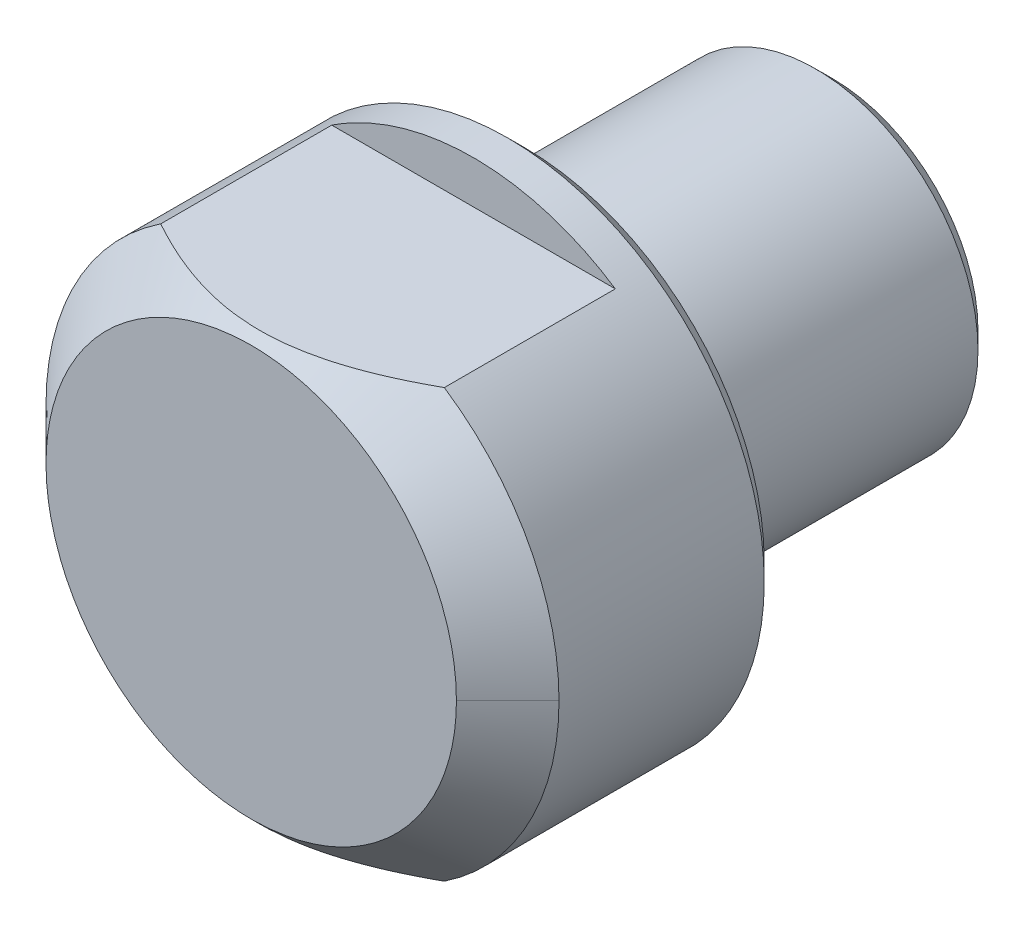
ISO-10303-21;
HEADER;
FILE_DESCRIPTION(('STEP AP214'),'2;1');
FILE_NAME('part.step','',(''),(''),'','','');
FILE_SCHEMA(('AUTOMOTIVE_DESIGN { 1 0 10303 214 1 1 1 1 }'));
ENDSEC;
DATA;
#1=APPLICATION_CONTEXT('core data for automotive mechanical design processes');
#2=APPLICATION_PROTOCOL_DEFINITION('international standard','automotive_design',2000,#1);
#3=PRODUCT_CONTEXT('',#1,'mechanical');
#4=PRODUCT('Part','Part','',(#3));
#5=PRODUCT_RELATED_PRODUCT_CATEGORY('part','',(#4));
#6=PRODUCT_DEFINITION_FORMATION('','',#4);
#7=PRODUCT_DEFINITION_CONTEXT('part definition',#1,'design');
#8=PRODUCT_DEFINITION('design','',#6,#7);
#9=PRODUCT_DEFINITION_SHAPE('','',#8);
#10=(LENGTH_UNIT() NAMED_UNIT(*) SI_UNIT(.MILLI.,.METRE.));
#11=(NAMED_UNIT(*) PLANE_ANGLE_UNIT() SI_UNIT($,.RADIAN.));
#12=(NAMED_UNIT(*) SI_UNIT($,.STERADIAN.) SOLID_ANGLE_UNIT());
#13=UNCERTAINTY_MEASURE_WITH_UNIT(LENGTH_MEASURE(1.E-05),#10,'distance_accuracy_value','');
#14=(GEOMETRIC_REPRESENTATION_CONTEXT(3) GLOBAL_UNCERTAINTY_ASSIGNED_CONTEXT((#13)) GLOBAL_UNIT_ASSIGNED_CONTEXT((#10,
#11,#12)) REPRESENTATION_CONTEXT('',''));
#15=CARTESIAN_POINT('',(0.,0.,0.));
#16=DIRECTION('',(0.,0.,1.));
#17=DIRECTION('',(1.,0.,0.));
#18=AXIS2_PLACEMENT_3D('',#15,#16,#17);
#19=CARTESIAN_POINT('',(-12.,-12.00000046191,34.));
#20=DIRECTION('',(0.,0.,1.));
#21=DIRECTION('',(1.,0.,0.));
#22=AXIS2_PLACEMENT_3D('',#19,#20,#21);
#23=PLANE('',#22);
#24=CARTESIAN_POINT('',(-11.9999243527896,-6.48420379889547E-09,34.));
#25=CARTESIAN_POINT('',(-11.9998701821244,-1.18188406089611,34.));
#26=CARTESIAN_POINT('',(-11.7693491699001,-2.34106911253026,34.));
#27=CARTESIAN_POINT('',(-11.5389343924907,-3.49971995772457,34.));
#28=CARTESIAN_POINT('',(-11.0864844987324,-4.59217224546722,34.));
#29=CARTESIAN_POINT('',(-10.6344555101708,-5.68360824643114,34.));
#30=CARTESIAN_POINT('',(-9.97757244564464,-6.66680077432835,34.));
#31=CARTESIAN_POINT('',(-9.32130046645815,-7.6490786576377,34.));
#32=CARTESIAN_POINT('',(-8.48522787895268,-8.48522788821352,34.));
#33=CARTESIAN_POINT('',(-7.64993307325746,-9.32059926567956,34.));
#34=CARTESIAN_POINT('',(-6.66680076343875,-9.97757245292084,34.));
#35=CARTESIAN_POINT('',(-5.68458304219019,-10.6339344709818,34.));
#36=CARTESIAN_POINT('',(-4.59217223336735,-11.0864845037443,34.));
#37=CARTESIAN_POINT('',(-3.5007776727487,-11.5386135381476,34.));
#38=CARTESIAN_POINT('',(-2.3410690996851,-11.7693491724552,34.));
#39=CARTESIAN_POINT('',(-1.18243938059112,-11.9998701579616,34.));
#40=CARTESIAN_POINT('',(6.61260109169337E-09,-11.9999243527896,34.));
#41=CARTESIAN_POINT('',(1.18133939383284,-11.9999784972012,34.));
#42=CARTESIAN_POINT('',(2.34106911265618,-11.7693491698751,34.));
#43=CARTESIAN_POINT('',(3.49971995783659,-11.5389343924553,34.));
#44=CARTESIAN_POINT('',(4.59217224558585,-11.0864844986832,34.));
#45=CARTESIAN_POINT('',(5.68360824653329,-10.6344555101174,34.));
#46=CARTESIAN_POINT('',(6.66680077443512,-9.9775724455733,34.));
#47=CARTESIAN_POINT('',(7.64907865774437,-9.32130046637198,34.));
#48=CARTESIAN_POINT('',(8.48522788830431,-8.48522787886189,34.));
#49=CARTESIAN_POINT('',(9.32059926576398,-7.64993307315255,34.));
#50=CARTESIAN_POINT('',(9.97757245299216,-6.666800763332,34.));
#51=CARTESIAN_POINT('',(10.6339344710483,-5.68458304206927,34.));
#52=CARTESIAN_POINT('',(11.0864845037934,-4.59217223324872,34.));
#53=CARTESIAN_POINT('',(11.5386135381849,-3.50077767261899,34.));
#54=CARTESIAN_POINT('',(11.7693491724802,-2.34106909955917,34.));
#55=CARTESIAN_POINT('',(11.9998701579746,-1.18243938046758,34.));
#56=CARTESIAN_POINT('',(11.9999243527896,6.74099838449127E-09,34.));
#57=B_SPLINE_CURVE_WITH_KNOTS('',2,(#24,#25,#26,#27,#28,#29,#30,#31,#32,#33,#34,#35,#36,#37,#38,
#39,#40,#41,#42,#43,#44,#45,#46,#47,#48,#49,#50,#51,#52,#53,#54,#55,#56),.UNSPECIFIED.,.F.,.F.,
(3,2,2,2,2,2,2,2,2,2,2,2,2,2,2,2,3),(0.,0.0625,0.125,0.1875,0.25,0.3125,0.375,0.4375,0.5,0.5625,
0.625,0.6875,0.75,0.8125,0.875,0.9375,1.),.UNSPECIFIED.);
#58=CARTESIAN_POINT('',(-11.9999241107255,-3.24211976903176E-09,33.9999648157087));
#59=VERTEX_POINT('',#58);
#60=CARTESIAN_POINT('',(11.9999241107255,2.80589656553716E-09,33.9999648157087));
#61=VERTEX_POINT('',#60);
#62=EDGE_CURVE('E115',#59,#61,#57,.T.);
#63=ORIENTED_EDGE('',*,*,#62,.T.);
#64=CARTESIAN_POINT('',(11.9999239390287,5.05574748732585E-09,34.));
#65=CARTESIAN_POINT('',(11.9998697685014,1.18188401875769,34.));
#66=CARTESIAN_POINT('',(11.7693487643539,2.3410690304803,34.));
#67=CARTESIAN_POINT('',(11.538933995022,3.49971983575883,34.));
#68=CARTESIAN_POINT('',(11.0864841169577,4.59217208594335,34.));
#69=CARTESIAN_POINT('',(10.6344551441014,5.68360804932165,34.));
#70=CARTESIAN_POINT('',(9.97757210228656,6.66680054345005,34.));
#71=CARTESIAN_POINT('',(9.32130014582751,7.64907839296616,34.));
#72=CARTESIAN_POINT('',(8.48522758718247,8.48522759483742,34.));
#73=CARTESIAN_POINT('',(7.64993281033221,9.32059894361422,34.));
#74=CARTESIAN_POINT('',(6.66680053444879,9.977572108301,34.));
#75=CARTESIAN_POINT('',(5.68458284707842,10.6339341038455,34.));
#76=CARTESIAN_POINT('',(4.5921720759417,11.0864841211005,34.));
#77=CARTESIAN_POINT('',(3.50077755296465,11.5386131400147,34.));
#78=CARTESIAN_POINT('',(2.3410690198626,11.7693487664659,34.));
#79=CARTESIAN_POINT('',(1.18243934073473,11.9998697441149,34.));
#80=CARTESIAN_POINT('',(-5.76997477574892E-09,11.9999239390287,34.));
#81=CARTESIAN_POINT('',(-1.18133935225094,11.999978083526,34.));
#82=CARTESIAN_POINT('',(-2.34106903118081,11.7693487642146,34.));
#83=CARTESIAN_POINT('',(-3.49971983645007,11.5389339948129,34.));
#84=CARTESIAN_POINT('',(-4.59217208660322,11.0864841166844,34.));
#85=CARTESIAN_POINT('',(-5.68360804998319,10.6344551437502,34.));
#86=CARTESIAN_POINT('',(-6.66680054404391,9.97757210188975,34.));
#87=CARTESIAN_POINT('',(-7.64907839353175,9.32130014535888,34.));
#88=CARTESIAN_POINT('',(-8.48522759534245,8.48522758667744,34.));
#89=CARTESIAN_POINT('',(-9.32059894404942,7.64993280980013,34.));
#90=CARTESIAN_POINT('',(-9.97757210869781,6.66680053385493,34.));
#91=CARTESIAN_POINT('',(-10.6339341041703,5.68458284647319,34.));
#92=CARTESIAN_POINT('',(-11.0864841213739,4.59217207528184,34.));
#93=CARTESIAN_POINT('',(-11.5386131402193,3.50077755229182,34.));
#94=CARTESIAN_POINT('',(-11.7693487666052,2.34106901916209,34.));
#95=CARTESIAN_POINT('',(-11.9998697441876,1.18243934001341,34.));
#96=CARTESIAN_POINT('',(-11.9999239390287,-6.48420379889547E-09,34.));
#97=B_SPLINE_CURVE_WITH_KNOTS('',2,(#64,#65,#66,#67,#68,#69,#70,#71,#72,#73,#74,#75,#76,#77,#78,
#79,#80,#81,#82,#83,#84,#85,#86,#87,#88,#89,#90,#91,#92,#93,#94,#95,#96),.UNSPECIFIED.,.F.,.F.,
(3,2,2,2,2,2,2,2,2,2,2,2,2,2,2,2,3),(0.,0.0625,0.125,0.1875,0.25,0.3125,0.375,0.4375,0.5,0.5625,
0.625,0.6875,0.75,0.8125,0.875,0.9375,1.),.UNSPECIFIED.);
#98=EDGE_CURVE('E134',#61,#59,#97,.T.);
#99=ORIENTED_EDGE('',*,*,#98,.T.);
#100=EDGE_LOOP('',(#63,#99));
#101=FACE_BOUND('',#100,.T.);
#102=ADVANCED_FACE('F16',(#101),#23,.T.);
#103=CARTESIAN_POINT('',(-8.291561975888,-15.01539198559,21.));
#104=DIRECTION('',(0.,0.,1.));
#105=DIRECTION('',(1.,0.,0.));
#106=AXIS2_PLACEMENT_3D('',#103,#104,#105);
#107=PLANE('',#106);
#108=CARTESIAN_POINT('',(-8.29156197588815,-12.5000000000002,21.));
#109=CARTESIAN_POINT('',(-7.3745195762119,-13.1082002763477,21.));
#110=CARTESIAN_POINT('',(-6.37910392753331,-13.5759726385158,21.));
#111=CARTESIAN_POINT('',(-5.38393296632282,-14.0436300155165,21.));
#112=CARTESIAN_POINT('',(-4.33012701892199,-14.3614066163451,21.));
#113=CARTESIAN_POINT('',(-3.27737422970128,-14.678865635908,21.));
#114=CARTESIAN_POINT('',(-2.18848129473649,-14.8394929031483,21.));
#115=CARTESIAN_POINT('',(-1.10067658337028,-14.999959641858,21.));
#116=CARTESIAN_POINT('',(0.,-15.,21.));
#117=CARTESIAN_POINT('',(1.09957658336247,-15.0000403178087,21.));
#118=CARTESIAN_POINT('',(2.18848129473649,-14.8394929031483,21.));
#119=CARTESIAN_POINT('',(3.27629777073172,-14.6791059372166,21.));
#120=CARTESIAN_POINT('',(4.330127018922,-14.3614066163451,21.));
#121=CARTESIAN_POINT('',(5.38290308562081,-14.0440247995144,21.));
#122=CARTESIAN_POINT('',(6.37910392753333,-13.5759726385158,21.));
#123=CARTESIAN_POINT('',(7.37405875763431,-13.1085059001513,21.));
#124=CARTESIAN_POINT('',(8.29156197588816,-12.5000000000002,21.));
#125=B_SPLINE_CURVE_WITH_KNOTS('',2,(#108,#109,#110,#111,#112,#113,#114,#115,#116,#117,#118,
#119,#120,#121,#122,#123,#124),.UNSPECIFIED.,.F.,.F.,(3,2,2,2,2,2,2,2,3),(0.,0.125,0.25,0.375,
0.5,0.625,0.75,0.875,1.),.UNSPECIFIED.);
#126=CARTESIAN_POINT('',(-8.29156197588811,-12.5000000000001,21.));
#127=VERTEX_POINT('',#126);
#128=CARTESIAN_POINT('',(8.29156197588808,-12.5000000000001,21.));
#129=VERTEX_POINT('',#128);
#130=EDGE_CURVE('E488',#127,#129,#125,.T.);
#131=ORIENTED_EDGE('',*,*,#130,.T.);
#132=DIRECTION('',(-1.,0.,0.));
#133=VECTOR('',#132,1.);
#134=CARTESIAN_POINT('',(-9.99200722162641E-13,-12.5,21.));
#135=LINE('',#134,#133);
#136=EDGE_CURVE('E495',#129,#127,#135,.T.);
#137=ORIENTED_EDGE('',*,*,#136,.T.);
#138=EDGE_LOOP('',(#131,#137));
#139=FACE_BOUND('',#138,.T.);
#140=ADVANCED_FACE('F160',(#139),#107,.T.);
#141=CARTESIAN_POINT('',(0.,0.,33.9999299211796));
#142=DIRECTION('',(0.,0.,-1.));
#143=DIRECTION('',(-1.,0.,0.));
#144=AXIS2_PLACEMENT_3D('',#141,#142,#143);
#145=CONICAL_SURFACE('',#144,11.9999243527896,0.78539209147865);
#146=DIRECTION('',(-0.70710246276539,-2.97912677885524E-10,0.707111099581332));
#147=VECTOR('',#146,1.);
#148=CARTESIAN_POINT('',(13.499954398765,5.68772954140161E-09,32.499880707705));
#149=LINE('',#148,#147);
#150=CARTESIAN_POINT('',(14.99995419707,3.15974638310727E-09,30.9998627613045));
#151=VERTEX_POINT('',#150);
#152=EDGE_CURVE('E128',#151,#61,#149,.T.);
#153=ORIENTED_EDGE('',*,*,#152,.T.);
#154=ORIENTED_EDGE('',*,*,#62,.F.);
#155=DIRECTION('',(-0.70710246276539,-3.82085204968641E-10,-0.707111099581332));
#156=VECTOR('',#155,1.);
#157=CARTESIAN_POINT('',(-13.499954398765,-7.29474597407936E-09,32.499880707705));
#158=LINE('',#157,#156);
#159=CARTESIAN_POINT('',(-14.9999541970875,-6.07894559484566E-09,30.999862761287));
#160=VERTEX_POINT('',#159);
#161=EDGE_CURVE('E125',#59,#160,#158,.T.);
#162=ORIENTED_EDGE('',*,*,#161,.T.);
#163=CARTESIAN_POINT('',(0.,0.,30.99981784131));
#164=DIRECTION('',(0.,0.,1.));
#165=DIRECTION('',(1.,0.,0.));
#166=AXIS2_PLACEMENT_3D('',#163,#164,#165);
#167=CIRCLE('',#166,15.);
#168=CARTESIAN_POINT('',(-8.29156197588946,-12.5000000000007,30.9998178413107));
#169=VERTEX_POINT('',#168);
#170=EDGE_CURVE('E497',#160,#169,#167,.T.);
#171=ORIENTED_EDGE('',*,*,#170,.T.);
#172=CARTESIAN_POINT('',(-8.29156197589155,-12.5000000000023,30.9998178413129));
#173=CARTESIAN_POINT('',(-8.04159538373175,-12.5000040380364,31.1379630767079));
#174=CARTESIAN_POINT('',(-7.78979971618752,-12.4999586238793,31.2728751221349));
#175=CARTESIAN_POINT('',(-7.29051369287207,-12.4998358769905,31.5307853038968));
#176=CARTESIAN_POINT('',(-7.0431495139075,-12.4997596299867,31.6540281779718));
#177=CARTESIAN_POINT('',(-6.55210776095944,-12.4996361078085,31.8886278219121));
#178=CARTESIAN_POINT('',(-6.30854943111576,-12.499588016574,32.0002330705373));
#179=CARTESIAN_POINT('',(-5.8244296730648,-12.4995590982013,32.2115454185947));
#180=CARTESIAN_POINT('',(-5.58397598796708,-12.4995764210912,32.3114985416598));
#181=CARTESIAN_POINT('',(-5.10529587391244,-12.4996766860168,32.4995126538032));
#182=CARTESIAN_POINT('',(-4.86716124358852,-12.4997579959097,32.5878064799175));
#183=CARTESIAN_POINT('',(-4.39227430441573,-12.4999140352618,32.7525238207631));
#184=CARTESIAN_POINT('',(-4.15559387018792,-12.499988865502,32.8291537053185));
#185=CARTESIAN_POINT('',(-3.69745858428332,-12.5000102723048,32.9661375920962));
#186=CARTESIAN_POINT('',(-3.4762439130335,-12.4999663314688,33.027292429739));
#187=CARTESIAN_POINT('',(-3.03536833646661,-12.4999130430869,33.1384037077579));
#188=CARTESIAN_POINT('',(-2.81575474367298,-12.4999030688845,33.1885468541422));
#189=CARTESIAN_POINT('',(-2.37710921248065,-12.4999431525524,33.2776721015382));
#190=CARTESIAN_POINT('',(-2.15810400181915,-12.4999924654425,33.316785240474));
#191=CARTESIAN_POINT('',(-1.72314442602087,-12.5000073727083,33.3834201874841));
#192=CARTESIAN_POINT('',(-1.50722558474451,-12.4999747427222,33.411172945136));
#193=CARTESIAN_POINT('',(-1.07627657652546,-12.4999355417714,33.4554759966663));
#194=CARTESIAN_POINT('',(-0.861257013072269,-12.4999287297132,33.472128730857));
#195=CARTESIAN_POINT('',(-0.431002653256192,-12.4999627349683,33.4942992393994));
#196=CARTESIAN_POINT('',(-0.215768811769113,-12.5000034729756,33.4998355124143));
#197=CARTESIAN_POINT('',(0.214718521108538,-12.4999965267228,33.4998608680216));
#198=CARTESIAN_POINT('',(0.42997201256184,-12.4999488346827,33.4943489786075));
#199=CARTESIAN_POINT('',(0.860258210818122,-12.4999070967456,33.4722191604876));
#200=CARTESIAN_POINT('',(1.07528998598339,-12.4999131384099,33.4555831453646));
#201=CARTESIAN_POINT('',(1.50625656332765,-12.4999595734962,33.4113041207847));
#202=CARTESIAN_POINT('',(1.72218079109061,-12.5000002899734,33.383558902392));
#203=CARTESIAN_POINT('',(2.15747841042425,-12.4999997032247,33.316890194706));
#204=CARTESIAN_POINT('',(2.37681380419531,-12.4999564524454,33.2777196201537));
#205=CARTESIAN_POINT('',(2.81609036485942,-12.4999194635698,33.1884620800518));
#206=CARTESIAN_POINT('',(3.03600502656535,-12.4999263491262,33.138245175623));
#207=CARTESIAN_POINT('',(3.47745527683167,-12.4999728179117,33.026965924921));
#208=CARTESIAN_POINT('',(3.69894372639307,-12.5000130128658,32.9657175869977));
#209=CARTESIAN_POINT('',(4.15724699183952,-12.4999859182214,32.8286330003127));
#210=CARTESIAN_POINT('',(4.39382627179605,-12.4999095282918,32.7520117277423));
#211=CARTESIAN_POINT('',(4.86851363895493,-12.4997515600219,32.5873199274591));
#212=CARTESIAN_POINT('',(5.10654986111973,-12.4996699064984,32.499043109831));
#213=CARTESIAN_POINT('',(5.58503475134922,-12.4995697775613,32.3110710709052));
#214=CARTESIAN_POINT('',(5.82539166252887,-12.4995529558014,32.2111431613292));
#215=CARTESIAN_POINT('',(6.30931855808456,-12.4995831968584,31.9998892817425));
#216=CARTESIAN_POINT('',(6.55278087269921,-12.4996321186469,31.888317484974));
#217=CARTESIAN_POINT('',(7.04363046514018,-12.4997572573515,31.653792727589));
#218=CARTESIAN_POINT('',(7.29089859667961,-12.499834288076,31.5305915093862));
#219=CARTESIAN_POINT('',(7.78999169174941,-12.4999582257258,31.2727726399902));
#220=CARTESIAN_POINT('',(8.04169059320857,-12.5000040334805,31.1379104817868));
#221=CARTESIAN_POINT('',(8.29156197588987,-12.5000000000028,30.9998178413134));
#222=B_SPLINE_CURVE_WITH_KNOTS('',3,(#172,#173,#174,#175,#176,#177,#178,#179,#180,#181,#182,
#183,#184,#185,#186,#187,#188,#189,#190,#191,#192,#193,#194,#195,#196,#197,#198,#199,#200,#201,
#202,#203,#204,#205,#206,#207,#208,#209,#210,#211,#212,#213,#214,#215,#216,#217,#218,#219,#220,
#221),.UNSPECIFIED.,.F.,.F.,(4,2,2,2,2,2,2,2,2,2,2,2,2,2,2,2,2,2,2,2,2,2,2,2,4),(0.,
0.856830268481494,1.68580359133839,2.48937906127282,3.27040114360204,4.03212280052507,
4.77821679680453,5.46653717476696,6.14208772419612,6.80923753538936,7.46205601160262,
8.10876308884834,8.75439309995065,9.40007991544187,10.046819096659,10.6996505167697,
11.3678048449818,12.0442845066453,12.7334703570204,13.4792680800977,14.2406954516711,
15.0214206660179,15.8246926813252,16.653352534691,17.5098564445272),.UNSPECIFIED.);
#223=CARTESIAN_POINT('',(8.29156197588854,-12.5000000000008,30.9998178413113));
#224=VERTEX_POINT('',#223);
#225=EDGE_CURVE('E129',#169,#224,#222,.T.);
#226=ORIENTED_EDGE('',*,*,#225,.T.);
#227=CARTESIAN_POINT('',(0.,0.,30.99981784131));
#228=DIRECTION('',(0.,0.,1.));
#229=DIRECTION('',(1.,0.,0.));
#230=AXIS2_PLACEMENT_3D('',#227,#228,#229);
#231=CIRCLE('',#230,15.);
#232=EDGE_CURVE('E499',#224,#151,#231,.T.);
#233=ORIENTED_EDGE('',*,*,#232,.T.);
#234=EDGE_LOOP('',(#153,#154,#162,#171,#226,#233));
#235=FACE_BOUND('',#234,.T.);
#236=ADVANCED_FACE('F123',(#235),#145,.T.);
#237=CARTESIAN_POINT('',(8.291561975888,-12.5,21.));
#238=DIRECTION('',(0.,1.,0.));
#239=DIRECTION('',(-1.,0.,0.));
#240=AXIS2_PLACEMENT_3D('',#237,#238,#239);
#241=PLANE('',#240);
#242=DIRECTION('',(0.,0.,1.));
#243=VECTOR('',#242,1.);
#244=CARTESIAN_POINT('',(8.29156197588815,-12.5000000000002,24.99999086816));
#245=LINE('',#244,#243);
#246=EDGE_CURVE('E493',#129,#224,#245,.T.);
#247=ORIENTED_EDGE('',*,*,#246,.T.);
#248=ORIENTED_EDGE('',*,*,#225,.F.);
#249=DIRECTION('',(0.,0.,-1.));
#250=VECTOR('',#249,1.);
#251=CARTESIAN_POINT('',(-8.29156197588815,-12.5000000000002,24.99999086816));
#252=LINE('',#251,#250);
#253=EDGE_CURVE('E491',#169,#127,#252,.T.);
#254=ORIENTED_EDGE('',*,*,#253,.T.);
#255=ORIENTED_EDGE('',*,*,#136,.F.);
#256=EDGE_LOOP('',(#247,#248,#254,#255));
#257=FACE_BOUND('',#256,.T.);
#258=ADVANCED_FACE('F168',(#257),#241,.F.);
#259=CARTESIAN_POINT('',(-8.291562819795,12.49999944022,21.));
#260=DIRECTION('',(0.,0.,1.));
#261=DIRECTION('',(1.,0.,0.));
#262=AXIS2_PLACEMENT_3D('',#259,#260,#261);
#263=PLANE('',#262);
#264=CARTESIAN_POINT('',(8.29156281979303,12.499999440217,21.));
#265=CARTESIAN_POINT('',(7.37452035510216,13.1081998488277,21.));
#266=CARTESIAN_POINT('',(6.3791046149431,13.5759723155143,21.));
#267=CARTESIAN_POINT('',(5.38393356221149,14.0436297970376,21.));
#268=CARTESIAN_POINT('',(4.33012750370845,14.3614064701765,21.));
#269=CARTESIAN_POINT('',(3.27737460334034,14.6788655620245,21.));
#270=CARTESIAN_POINT('',(2.18848154519891,14.8394928662109,21.));
#271=CARTESIAN_POINT('',(1.10067671061955,14.9999596418533,21.));
#272=CARTESIAN_POINT('',(0.,15.,21.));
#273=CARTESIAN_POINT('',(-1.09957671063141,15.0000403178133,21.));
#274=CARTESIAN_POINT('',(-2.1884815451989,14.8394928662109,21.));
#275=CARTESIAN_POINT('',(-3.27629814440228,14.6791058633537,21.));
#276=CARTESIAN_POINT('',(-4.33012750370844,14.3614064701765,21.));
#277=CARTESIAN_POINT('',(-5.38290368156063,14.0440245810675,21.));
#278=CARTESIAN_POINT('',(-6.3791046149431,13.5759723155143,21.));
#279=CARTESIAN_POINT('',(-7.37405953656944,13.1085054726463,21.));
#280=CARTESIAN_POINT('',(-8.29156281979303,12.499999440217,21.));
#281=B_SPLINE_CURVE_WITH_KNOTS('',2,(#264,#265,#266,#267,#268,#269,#270,#271,#272,#273,#274,
#275,#276,#277,#278,#279,#280),.UNSPECIFIED.,.F.,.F.,(3,2,2,2,2,2,2,2,3),(0.,0.125,0.25,0.375,
0.5,0.625,0.75,0.875,1.),.UNSPECIFIED.);
#282=CARTESIAN_POINT('',(8.29156281979352,12.4999994402185,21.));
#283=VERTEX_POINT('',#282);
#284=CARTESIAN_POINT('',(-8.29156281979401,12.4999994402185,21.));
#285=VERTEX_POINT('',#284);
#286=EDGE_CURVE('E196',#283,#285,#281,.T.);
#287=ORIENTED_EDGE('',*,*,#286,.T.);
#288=DIRECTION('',(1.,0.,0.));
#289=VECTOR('',#288,1.);
#290=CARTESIAN_POINT('',(-2.50190493322755E-12,12.49999944022,21.));
#291=LINE('',#290,#289);
#292=EDGE_CURVE('E494',#285,#283,#291,.T.);
#293=ORIENTED_EDGE('',*,*,#292,.T.);
#294=EDGE_LOOP('',(#287,#293));
#295=FACE_BOUND('',#294,.T.);
#296=ADVANCED_FACE('F201',(#295),#263,.T.);
#297=CARTESIAN_POINT('',(0.,0.,33.9999294893786));
#298=DIRECTION('',(0.,0.,-1.));
#299=DIRECTION('',(-1.,0.,0.));
#300=AXIS2_PLACEMENT_3D('',#297,#298,#299);
#301=CONICAL_SURFACE('',#300,11.9999239390287,0.785392056246328);
#302=ORIENTED_EDGE('',*,*,#161,.F.);
#303=ORIENTED_EDGE('',*,*,#98,.F.);
#304=ORIENTED_EDGE('',*,*,#152,.F.);
#305=CARTESIAN_POINT('',(0.,0.,30.99981678435));
#306=DIRECTION('',(0.,0.,1.));
#307=DIRECTION('',(1.,0.,0.));
#308=AXIS2_PLACEMENT_3D('',#305,#306,#307);
#309=CIRCLE('',#308,15.);
#310=CARTESIAN_POINT('',(8.29156281979128,12.4999994402182,30.9998167843497));
#311=VERTEX_POINT('',#310);
#312=EDGE_CURVE('E535',#151,#311,#309,.T.);
#313=ORIENTED_EDGE('',*,*,#312,.T.);
#314=CARTESIAN_POINT('',(8.29156281978907,12.4999994402186,30.9998167843486));
#315=CARTESIAN_POINT('',(8.04159600378416,12.5000034782976,31.1379621670985));
#316=CARTESIAN_POINT('',(7.78980010957212,12.4999580624425,31.2728743556633));
#317=CARTESIAN_POINT('',(7.29051365034272,12.4998353105346,31.5307847976618));
#318=CARTESIAN_POINT('',(7.04314926261571,12.4997590602665,31.6540277897419));
#319=CARTESIAN_POINT('',(6.55210710752201,12.4996355316624,31.8886276438281));
#320=CARTESIAN_POINT('',(6.30854858476886,12.4995874372647,32.0002329855589));
#321=CARTESIAN_POINT('',(5.82442845383683,12.499558514549,32.211545493679));
#322=CARTESIAN_POINT('',(5.58397458920647,12.4995758362021,32.311498684705));
#323=CARTESIAN_POINT('',(5.10529412652462,12.4996761013798,32.499512907217));
#324=CARTESIAN_POINT('',(4.86715932747404,12.4997574126915,32.5878067767006));
#325=CARTESIAN_POINT('',(4.39227205757038,12.499913461198,32.7525241766089));
#326=CARTESIAN_POINT('',(4.15559146162841,12.4999882990439,32.8291540777581));
#327=CARTESIAN_POINT('',(3.69745611357748,12.5000097186642,32.9661379042368));
#328=CARTESIAN_POINT('',(3.4762415452795,12.499965783303,33.0272926767852));
#329=CARTESIAN_POINT('',(3.03536619021964,12.4999124986909,33.1384038354291));
#330=CARTESIAN_POINT('',(2.81575271603888,12.4999025229129,33.1885469278678));
#331=CARTESIAN_POINT('',(2.37710743845358,12.4999426004524,33.27767207692));
#332=CARTESIAN_POINT('',(2.15810236288261,12.4999919088232,33.3167851719938));
#333=CARTESIAN_POINT('',(1.72314306101109,12.5000068098252,33.3834200403621));
#334=CARTESIAN_POINT('',(1.50722435855635,12.4999741780389,33.411172763259));
#335=CARTESIAN_POINT('',(1.07627561010742,12.499934976752,33.4554757566761));
#336=CARTESIAN_POINT('',(0.861256167490409,12.4999281661297,33.4721284664989));
#337=CARTESIAN_POINT('',(0.431002033265427,12.4999621739626,33.4942989385627));
#338=CARTESIAN_POINT('',(0.215768296485437,12.5000029131159,33.4998351985629));
#339=CARTESIAN_POINT('',(-0.214718820415744,12.4999959670123,33.499860539881));
#340=CARTESIAN_POINT('',(-0.429972200599613,12.4999482739777,33.4943486495107));
#341=CARTESIAN_POINT('',(-0.860258161993046,12.499906533756,33.4722188406794));
#342=CARTESIAN_POINT('',(-1.07528981160477,12.4999125741259,33.4555828365756));
#343=CARTESIAN_POINT('',(-1.50625612148948,12.4999590094537,33.4113038442724));
#344=CARTESIAN_POINT('',(-1.7221802074413,12.4999997274909,33.3835586480402));
#345=CARTESIAN_POINT('',(-2.15747755748473,12.4999991462002,33.3168899929473));
#346=CARTESIAN_POINT('',(-2.37681282369824,12.4999558993667,33.2777194482814));
#347=CARTESIAN_POINT('',(-2.81608914301672,12.499918915751,33.1884619785325));
#348=CARTESIAN_POINT('',(-3.0360036908515,12.4999258025908,33.1382451141361));
#349=CARTESIAN_POINT('',(-3.47745372614306,12.499972268065,33.0269659547108));
#350=CARTESIAN_POINT('',(-3.69894207455531,12.5000124583151,32.965717667789));
#351=CARTESIAN_POINT('',(-4.15724536223642,12.4999853527583,32.828633125394));
#352=CARTESIAN_POINT('',(-4.3938247627358,12.4999089564093,32.7520118363069));
#353=CARTESIAN_POINT('',(-4.86851237740158,12.4997509804421,32.5873199826187));
#354=CARTESIAN_POINT('',(-5.1065487262864,12.4996693257509,32.4990431273627));
#355=CARTESIAN_POINT('',(-5.58503387941725,12.499569196649,32.3110709946884));
#356=CARTESIAN_POINT('',(-5.82539092647531,12.499552375951,32.2111430282152));
#357=CARTESIAN_POINT('',(-6.30931810527152,12.4995826206871,31.9998890158971));
#358=CARTESIAN_POINT('',(-6.55278056689144,12.4996315451406,31.8883171424914));
#359=CARTESIAN_POINT('',(-7.0436304667631,12.4997566892444,31.65379221306));
#360=CARTESIAN_POINT('',(-7.2908987583465,12.4998337227042,31.5305908986824));
#361=CARTESIAN_POINT('',(-7.7899921885026,12.4999576645565,31.2727718179236));
#362=CARTESIAN_POINT('',(-8.04169126461729,12.5000034737308,31.1379095438171));
#363=CARTESIAN_POINT('',(-8.29156281979339,12.4999994402176,30.9998167843471));
#364=B_SPLINE_CURVE_WITH_KNOTS('',3,(#314,#315,#316,#317,#318,#319,#320,#321,#322,#323,#324,
#325,#326,#327,#328,#329,#330,#331,#332,#333,#334,#335,#336,#337,#338,#339,#340,#341,#342,#343,
#344,#345,#346,#347,#348,#349,#350,#351,#352,#353,#354,#355,#356,#357,#358,#359,#360,#361,#362,
#363),.UNSPECIFIED.,.F.,.F.,(4,2,2,2,2,2,2,2,2,2,2,2,2,2,2,2,2,2,2,2,2,2,2,2,4),(0.,
0.856831070251337,1.68580511126222,2.48938122322277,3.27040388061722,4.03212605664281,
4.7782205289651,5.46654055761918,6.14209072464533,6.809240114114,7.46205816421179,
8.10876487469514,8.75439457121516,9.40008105355173,10.0468198570288,10.6996508470003,
11.3678047831075,12.044284085508,12.7334696030346,13.4792676847604,14.2406954514544,
15.0214211073244,15.8246936189927,16.6533540305628,17.5098585661469),.UNSPECIFIED.);
#365=CARTESIAN_POINT('',(-8.29156281979361,12.4999994402179,30.9998167843489));
#366=VERTEX_POINT('',#365);
#367=EDGE_CURVE('E138',#311,#366,#364,.T.);
#368=ORIENTED_EDGE('',*,*,#367,.T.);
#369=CARTESIAN_POINT('',(0.,0.,30.99981678435));
#370=DIRECTION('',(0.,0.,1.));
#371=DIRECTION('',(1.,0.,0.));
#372=AXIS2_PLACEMENT_3D('',#369,#370,#371);
#373=CIRCLE('',#372,15.);
#374=EDGE_CURVE('E137',#366,#160,#373,.T.);
#375=ORIENTED_EDGE('',*,*,#374,.T.);
#376=EDGE_LOOP('',(#302,#303,#304,#313,#368,#375));
#377=FACE_BOUND('',#376,.T.);
#378=ADVANCED_FACE('F133',(#377),#301,.T.);
#379=CARTESIAN_POINT('',(-8.291562819795,12.49999944022,21.));
#380=DIRECTION('',(0.,-1.,0.));
#381=DIRECTION('',(1.,0.,0.));
#382=AXIS2_PLACEMENT_3D('',#379,#380,#381);
#383=PLANE('',#382);
#384=DIRECTION('',(0.,0.,1.));
#385=VECTOR('',#384,1.);
#386=CARTESIAN_POINT('',(-8.29156281979303,12.499999440217,24.99998534849));
#387=LINE('',#386,#385);
#388=EDGE_CURVE('E498',#285,#366,#387,.T.);
#389=ORIENTED_EDGE('',*,*,#388,.T.);
#390=ORIENTED_EDGE('',*,*,#367,.F.);
#391=DIRECTION('',(0.,0.,-1.));
#392=VECTOR('',#391,1.);
#393=CARTESIAN_POINT('',(8.29156281979303,12.499999440217,24.99998534849));
#394=LINE('',#393,#392);
#395=EDGE_CURVE('E553',#311,#283,#394,.T.);
#396=ORIENTED_EDGE('',*,*,#395,.T.);
#397=ORIENTED_EDGE('',*,*,#292,.F.);
#398=EDGE_LOOP('',(#389,#390,#396,#397));
#399=FACE_BOUND('',#398,.T.);
#400=ADVANCED_FACE('F210',(#399),#383,.F.);
#401=CARTESIAN_POINT('',(0.,0.,19.0001045414));
#402=DIRECTION('',(0.,0.,1.));
#403=DIRECTION('',(1.,0.,0.));
#404=AXIS2_PLACEMENT_3D('',#401,#402,#403);
#405=CYLINDRICAL_SURFACE('',#404,15.);
#406=CARTESIAN_POINT('',(0.,0.,19.0001045414));
#407=DIRECTION('',(0.,0.,1.));
#408=DIRECTION('',(1.,0.,0.));
#409=AXIS2_PLACEMENT_3D('',#406,#407,#408);
#410=CIRCLE('',#409,15.);
#411=CARTESIAN_POINT('',(14.9999538259581,1.67119158247539E-09,19.0000999499794));
#412=VERTEX_POINT('',#411);
#413=CARTESIAN_POINT('',(-14.9999538259582,-1.40770933654154E-08,19.0000999499794));
#414=VERTEX_POINT('',#413);
#415=EDGE_CURVE('E456',#412,#414,#410,.T.);
#416=ORIENTED_EDGE('',*,*,#415,.T.);
#417=CARTESIAN_POINT('',(0.,0.,19.00009254215));
#418=DIRECTION('',(0.,0.,1.));
#419=DIRECTION('',(-1.,-1.08618992723117E-09,0.));
#420=AXIS2_PLACEMENT_3D('',#417,#418,#419);
#421=CIRCLE('',#420,15.);
#422=EDGE_CURVE('E555',#414,#412,#421,.T.);
#423=ORIENTED_EDGE('',*,*,#422,.T.);
#424=EDGE_LOOP('',(#416,#423));
#425=FACE_BOUND('',#424,.T.);
#426=ORIENTED_EDGE('',*,*,#312,.F.);
#427=ORIENTED_EDGE('',*,*,#232,.F.);
#428=ORIENTED_EDGE('',*,*,#246,.F.);
#429=ORIENTED_EDGE('',*,*,#130,.F.);
#430=ORIENTED_EDGE('',*,*,#253,.F.);
#431=ORIENTED_EDGE('',*,*,#170,.F.);
#432=ORIENTED_EDGE('',*,*,#374,.F.);
#433=ORIENTED_EDGE('',*,*,#388,.F.);
#434=ORIENTED_EDGE('',*,*,#286,.F.);
#435=ORIENTED_EDGE('',*,*,#395,.F.);
#436=EDGE_LOOP('',(#426,#427,#428,#429,#430,#431,#432,#433,#434,#435));
#437=FACE_BOUND('',#436,.T.);
#438=ADVANCED_FACE('F213',(#425,#437),#405,.T.);
#439=CARTESIAN_POINT('',(0.,0.,18.0000799326298));
#440=DIRECTION('',(0.,0.,1.));
#441=DIRECTION('',(1.,0.,0.));
#442=AXIS2_PLACEMENT_3D('',#439,#440,#441);
#443=CONICAL_SURFACE('',#442,13.9999136844902,0.785392225965691);
#444=ORIENTED_EDGE('',*,*,#422,.F.);
#445=CARTESIAN_POINT('',(-14.9999144190638,-2.1723703622017E-08,19.0000925421462));
#446=DIRECTION('',(0.707102582775825,1.02406497193492E-09,-0.707110979572342));
#447=VECTOR('',#446,1.);
#448=LINE('',#445,#447);
#449=CARTESIAN_POINT('',(-13.9999075809024,-8.70722086608156E-09,18.0000434153367));
#450=VERTEX_POINT('',#449);
#451=EDGE_CURVE('E594',#414,#450,#448,.T.);
#452=ORIENTED_EDGE('',*,*,#451,.T.);
#453=CARTESIAN_POINT('',(0.,0.,18.0000799326298));
#454=DIRECTION('',(0.,0.,1.));
#455=DIRECTION('',(-1.,-1.44825517100336E-09,0.));
#456=AXIS2_PLACEMENT_3D('',#453,#454,#455);
#457=CIRCLE('',#456,13.9999136844902);
#458=CARTESIAN_POINT('',(13.9999075809023,1.57530583730069E-09,18.0000434153366));
#459=VERTEX_POINT('',#458);
#460=EDGE_CURVE('E252',#450,#459,#457,.T.);
#461=ORIENTED_EDGE('',*,*,#460,.T.);
#462=CARTESIAN_POINT('',(13.9999136844902,2.61358392014026E-09,18.0000799326298));
#463=DIRECTION('',(0.707102582775825,1.32005952456688E-10,0.707110979572342));
#464=VECTOR('',#463,1.);
#465=LINE('',#462,#464);
#466=EDGE_CURVE('E557',#459,#412,#465,.T.);
#467=ORIENTED_EDGE('',*,*,#466,.T.);
#468=EDGE_LOOP('',(#444,#452,#461,#467));
#469=FACE_BOUND('',#468,.T.);
#470=ADVANCED_FACE('F429',(#469),#443,.T.);
#471=CARTESIAN_POINT('',(0.,0.,18.0000905433395));
#472=DIRECTION('',(0.,0.,1.));
#473=DIRECTION('',(1.,0.,0.));
#474=AXIS2_PLACEMENT_3D('',#471,#472,#473);
#475=CONICAL_SURFACE('',#474,13.9999024896105,0.785391447190114);
#476=ORIENTED_EDGE('',*,*,#415,.F.);
#477=ORIENTED_EDGE('',*,*,#466,.F.);
#478=CARTESIAN_POINT('',(0.,0.,18.0000905433395));
#479=DIRECTION('',(0.,0.,1.));
#480=DIRECTION('',(1.,2.48914605423879E-10,0.));
#481=AXIS2_PLACEMENT_3D('',#478,#479,#480);
#482=CIRCLE('',#481,13.9999024896105);
#483=EDGE_CURVE('E264',#459,#450,#482,.T.);
#484=ORIENTED_EDGE('',*,*,#483,.T.);
#485=ORIENTED_EDGE('',*,*,#451,.F.);
#486=EDGE_LOOP('',(#476,#477,#484,#485));
#487=FACE_BOUND('',#486,.T.);
#488=ADVANCED_FACE('F420',(#487),#475,.T.);
#489=CARTESIAN_POINT('',(-14.,-13.99999917105,18.));
#490=DIRECTION('',(0.,0.,1.));
#491=DIRECTION('',(1.,0.,0.));
#492=AXIS2_PLACEMENT_3D('',#489,#490,#491);
#493=PLANE('',#492);
#494=CARTESIAN_POINT('',(9.5,0.,18.));
#495=CARTESIAN_POINT('',(9.49989162851263,0.935935568550806,18.));
#496=CARTESIAN_POINT('',(9.31746016383069,1.85335805915322,18.));
#497=CARTESIAN_POINT('',(9.13508072612596,2.77051891331537,18.));
#498=CARTESIAN_POINT('',(8.77685555885722,3.63549260746835,18.));
#499=CARTESIAN_POINT('',(8.41905128452985,4.49945000975913,18.));
#500=CARTESIAN_POINT('',(7.89896131687418,5.27791721368622,18.));
#501=CARTESIAN_POINT('',(7.37948242352927,6.05546976564986,18.));
#502=CARTESIAN_POINT('',(6.7175144212722,6.7175144212722,18.));
#503=CARTESIAN_POINT('',(6.05632419144429,7.37878121440231,18.));
#504=CARTESIAN_POINT('',(5.27791721368622,7.89896131687418,18.));
#505=CARTESIAN_POINT('',(4.5004248171057,8.41853023914822,18.));
#506=CARTESIAN_POINT('',(3.63549260746835,8.77685555885722,18.));
#507=CARTESIAN_POINT('',(2.77157664093338,9.13475986795926,18.));
#508=CARTESIAN_POINT('',(1.85335805915322,9.31746016383069,18.));
#509=CARTESIAN_POINT('',(0.936218328764275,9.49994579788597,18.));
#510=CARTESIAN_POINT('',(0.,9.5,18.));
#511=CARTESIAN_POINT('',(-0.935118328772749,9.50005413842981,18.));
#512=CARTESIAN_POINT('',(-1.85335805915322,9.31746016383069,18.));
#513=CARTESIAN_POINT('',(-2.77051891332856,9.13508072611978,18.));
#514=CARTESIAN_POINT('',(-3.63549260746835,8.77685555885722,18.));
#515=CARTESIAN_POINT('',(-4.49945000976011,8.41905128453016,18.));
#516=CARTESIAN_POINT('',(-5.27791721368622,7.89896131687418,18.));
#517=CARTESIAN_POINT('',(-6.05546976565723,7.37948242352338,18.));
#518=CARTESIAN_POINT('',(-6.7175144212722,6.7175144212722,18.));
#519=CARTESIAN_POINT('',(-7.37878121439498,6.05632419145014,18.));
#520=CARTESIAN_POINT('',(-7.89896131687418,5.27791721368622,18.));
#521=CARTESIAN_POINT('',(-8.41853023913932,4.50042481712414,18.));
#522=CARTESIAN_POINT('',(-8.77685555885722,3.63549260746835,18.));
#523=CARTESIAN_POINT('',(-9.13475986796204,2.77157664092974,18.));
#524=CARTESIAN_POINT('',(-9.31746016383069,1.85335805915322,18.));
#525=CARTESIAN_POINT('',(-9.4998915642114,0.936490897375282,18.));
#526=CARTESIAN_POINT('',(-9.5,0.,18.));
#527=B_SPLINE_CURVE_WITH_KNOTS('',2,(#494,#495,#496,#497,#498,#499,#500,#501,#502,#503,#504,
#505,#506,#507,#508,#509,#510,#511,#512,#513,#514,#515,#516,#517,#518,#519,#520,#521,#522,#523,
#524,#525,#526),.UNSPECIFIED.,.F.,.F.,(3,2,2,2,2,2,2,2,2,2,2,2,2,2,2,2,3),(0.,0.0625,0.125,
0.1875,0.25,0.3125,0.375,0.4375,0.5,0.5625,0.625,0.6875,0.75,0.8125,0.875,0.9375,1.),.UNSPECIFIED.);
#528=CARTESIAN_POINT('',(9.5,0.,18.));
#529=VERTEX_POINT('',#528);
#530=CARTESIAN_POINT('',(-9.5,0.,18.));
#531=VERTEX_POINT('',#530);
#532=EDGE_CURVE('E229',#529,#531,#527,.T.);
#533=ORIENTED_EDGE('',*,*,#532,.T.);
#534=CARTESIAN_POINT('',(-9.5,0.,18.));
#535=CARTESIAN_POINT('',(-9.49989162851263,-0.93593556855523,18.));
#536=CARTESIAN_POINT('',(-9.31746016383069,-1.85335805915321,18.));
#537=CARTESIAN_POINT('',(-9.13508072612506,-2.77051891331545,18.));
#538=CARTESIAN_POINT('',(-8.77685555885722,-3.63549260746835,18.));
#539=CARTESIAN_POINT('',(-8.41905128453053,-4.49945000975958,18.));
#540=CARTESIAN_POINT('',(-7.89896131687418,-5.27791721368622,18.));
#541=CARTESIAN_POINT('',(-7.37948242352632,-6.05546976565281,18.));
#542=CARTESIAN_POINT('',(-6.7175144212722,-6.7175144212722,18.));
#543=CARTESIAN_POINT('',(-6.05632419144576,-7.37878121440083,18.));
#544=CARTESIAN_POINT('',(-5.27791721368622,-7.89896131687418,18.));
#545=CARTESIAN_POINT('',(-4.50042481711344,-8.41853023914354,18.));
#546=CARTESIAN_POINT('',(-3.63549260746836,-8.77685555885722,18.));
#547=CARTESIAN_POINT('',(-2.771576640932,-9.13475986796131,18.));
#548=CARTESIAN_POINT('',(-1.85335805915322,-9.31746016383069,18.));
#549=CARTESIAN_POINT('',(-0.936218328755381,-9.49994579788597,18.));
#550=CARTESIAN_POINT('',(0.,-9.5,18.));
#551=CARTESIAN_POINT('',(0.935118328762367,-9.50005413842981,18.));
#552=CARTESIAN_POINT('',(1.85335805915322,-9.31746016383069,18.));
#553=CARTESIAN_POINT('',(2.77051891332134,-9.13508072612328,18.));
#554=CARTESIAN_POINT('',(3.63549260746836,-8.77685555885722,18.));
#555=CARTESIAN_POINT('',(4.4994500097621,-8.41905128452883,18.));
#556=CARTESIAN_POINT('',(5.27791721368622,-7.89896131687418,18.));
#557=CARTESIAN_POINT('',(6.05546976565278,-7.37948242352635,18.));
#558=CARTESIAN_POINT('',(6.7175144212722,-6.7175144212722,18.));
#559=CARTESIAN_POINT('',(7.37878121439351,-6.05632419145309,18.));
#560=CARTESIAN_POINT('',(7.89896131687418,-5.27791721368622,18.));
#561=CARTESIAN_POINT('',(8.41853023914373,-4.50042481711679,18.));
#562=CARTESIAN_POINT('',(8.77685555885722,-3.63549260746836,18.));
#563=CARTESIAN_POINT('',(9.13475986795934,-2.77157664093296,18.));
#564=CARTESIAN_POINT('',(9.31746016383069,-1.85335805915322,18.));
#565=CARTESIAN_POINT('',(9.49989156421139,-0.936490897385659,18.));
#566=CARTESIAN_POINT('',(9.5,0.,18.));
#567=B_SPLINE_CURVE_WITH_KNOTS('',2,(#534,#535,#536,#537,#538,#539,#540,#541,#542,#543,#544,
#545,#546,#547,#548,#549,#550,#551,#552,#553,#554,#555,#556,#557,#558,#559,#560,#561,#562,#563,
#564,#565,#566),.UNSPECIFIED.,.F.,.F.,(3,2,2,2,2,2,2,2,2,2,2,2,2,2,2,2,3),(0.,0.0625,0.125,
0.1875,0.25,0.3125,0.375,0.4375,0.5,0.5625,0.625,0.6875,0.75,0.8125,0.875,0.9375,1.),.UNSPECIFIED.);
#568=EDGE_CURVE('E239',#531,#529,#567,.T.);
#569=ORIENTED_EDGE('',*,*,#568,.T.);
#570=EDGE_LOOP('',(#533,#569));
#571=FACE_BOUND('',#570,.T.);
#572=ORIENTED_EDGE('',*,*,#460,.F.);
#573=ORIENTED_EDGE('',*,*,#483,.F.);
#574=EDGE_LOOP('',(#572,#573));
#575=FACE_BOUND('',#574,.T.);
#576=ADVANCED_FACE('F215',(#571,#575),#493,.F.);
#577=CARTESIAN_POINT('',(0.,0.,29.));
#578=DIRECTION('',(0.,0.,-1.));
#579=DIRECTION('',(-1.,0.,0.));
#580=AXIS2_PLACEMENT_3D('',#577,#578,#579);
#581=CONICAL_SURFACE('',#580,3.5,0.994837673637026);
#582=CARTESIAN_POINT('',(0.,0.,31.27292657619));
#583=VERTEX_POINT('',#582);
#584=VERTEX_LOOP('',#583);
#585=FACE_BOUND('',#584,.T.);
#586=CARTESIAN_POINT('',(0.,0.,29.));
#587=DIRECTION('',(0.,0.,1.));
#588=DIRECTION('',(-1.,0.,0.));
#589=AXIS2_PLACEMENT_3D('',#586,#587,#588);
#590=CIRCLE('',#589,3.5);
#591=CARTESIAN_POINT('',(-3.5,0.,29.));
#592=VERTEX_POINT('',#591);
#593=EDGE_CURVE('E391',#592,#592,#590,.F.);
#594=ORIENTED_EDGE('',*,*,#593,.T.);
#595=EDGE_LOOP('',(#594));
#596=FACE_BOUND('',#595,.T.);
#597=ADVANCED_FACE('F430',(#585,#596),#581,.F.);
#598=CARTESIAN_POINT('',(0.,0.,1.000078954868));
#599=DIRECTION('',(0.,0.,1.));
#600=DIRECTION('',(1.,0.,0.));
#601=AXIS2_PLACEMENT_3D('',#598,#599,#600);
#602=CYLINDRICAL_SURFACE('',#601,9.5);
#603=ORIENTED_EDGE('',*,*,#532,.F.);
#604=ORIENTED_EDGE('',*,*,#568,.F.);
#605=EDGE_LOOP('',(#603,#604));
#606=FACE_BOUND('',#605,.T.);
#607=CARTESIAN_POINT('',(0.,0.,1.000083260199));
#608=DIRECTION('',(0.,0.,1.));
#609=DIRECTION('',(-1.,-7.79243014899375E-10,0.));
#610=AXIS2_PLACEMENT_3D('',#607,#608,#609);
#611=CIRCLE('',#610,9.5);
#612=CARTESIAN_POINT('',(-9.49996373126162,-5.5954853841218E-09,1.00008082082871));
#613=VERTEX_POINT('',#612);
#614=CARTESIAN_POINT('',(9.49996373126154,6.53637106282844E-09,1.0000808208287));
#615=VERTEX_POINT('',#614);
#616=EDGE_CURVE('E389',#613,#615,#611,.T.);
#617=ORIENTED_EDGE('',*,*,#616,.T.);
#618=CARTESIAN_POINT('',(0.,0.,1.000078954868));
#619=DIRECTION('',(0.,0.,1.));
#620=DIRECTION('',(1.,0.,0.));
#621=AXIS2_PLACEMENT_3D('',#618,#619,#620);
#622=CIRCLE('',#621,9.5);
#623=EDGE_CURVE('E379',#615,#613,#622,.T.);
#624=ORIENTED_EDGE('',*,*,#623,.T.);
#625=EDGE_LOOP('',(#617,#624));
#626=FACE_BOUND('',#625,.T.);
#627=ADVANCED_FACE('F310',(#606,#626),#602,.T.);
#628=CARTESIAN_POINT('',(0.,0.,0.9998883810968));
#629=DIRECTION('',(0.,0.,1.));
#630=DIRECTION('',(1.,0.,0.));
#631=AXIS2_PLACEMENT_3D('',#628,#629,#630);
#632=CYLINDRICAL_SURFACE('',#631,3.5);
#633=ORIENTED_EDGE('',*,*,#593,.F.);
#634=EDGE_LOOP('',(#633));
#635=FACE_BOUND('',#634,.T.);
#636=CARTESIAN_POINT('',(0.,0.,0.9998858678166));
#637=DIRECTION('',(0.,0.,-1.));
#638=DIRECTION('',(1.,0.,0.));
#639=AXIS2_PLACEMENT_3D('',#636,#637,#638);
#640=CIRCLE('',#639,3.5);
#641=CARTESIAN_POINT('',(3.49995699905339,-7.13755213426555E-09,0.999900604690872));
#642=VERTEX_POINT('',#641);
#643=CARTESIAN_POINT('',(-3.49995699936576,1.37845252750574E-08,0.99990060611735));
#644=VERTEX_POINT('',#643);
#645=EDGE_CURVE('E293',#642,#644,#640,.T.);
#646=ORIENTED_EDGE('',*,*,#645,.T.);
#647=CARTESIAN_POINT('',(0.,0.,0.9998883810968));
#648=DIRECTION('',(0.,0.,-1.));
#649=DIRECTION('',(-1.,0.,0.));
#650=AXIS2_PLACEMENT_3D('',#647,#648,#649);
#651=CIRCLE('',#650,3.5);
#652=EDGE_CURVE('E368',#644,#642,#651,.T.);
#653=ORIENTED_EDGE('',*,*,#652,.T.);
#654=EDGE_LOOP('',(#646,#653));
#655=FACE_BOUND('',#654,.T.);
#656=ADVANCED_FACE('F299',(#635,#655),#632,.F.);
#657=CARTESIAN_POINT('',(0.,0.,6.6649593418E-05));
#658=DIRECTION('',(0.,0.,1.));
#659=DIRECTION('',(1.,0.,0.));
#660=AXIS2_PLACEMENT_3D('',#657,#658,#659);
#661=CONICAL_SURFACE('',#660,8.49992557939503,0.785389865146375);
#662=ORIENTED_EDGE('',*,*,#616,.F.);
#663=CARTESIAN_POINT('',(-9.49992559336076,-9.87034978117037E-09,1.00008326019924));
#664=DIRECTION('',(0.707100913412596,7.3467242215508E-10,-0.707112648911807));
#665=VECTOR('',#664,1.);
#666=LINE('',#663,#665);
#667=CARTESIAN_POINT('',(-8.4999274236111,-3.91600960081837E-09,3.25342177712441E-05));
#668=VERTEX_POINT('',#667);
#669=EDGE_CURVE('E377',#613,#668,#666,.T.);
#670=ORIENTED_EDGE('',*,*,#669,.T.);
#671=CARTESIAN_POINT('',(0.,0.,0.));
#672=DIRECTION('',(0.,0.,1.));
#673=DIRECTION('',(1.,0.,0.));
#674=AXIS2_PLACEMENT_3D('',#671,#672,#673);
#675=CIRCLE('',#674,8.49985893090775);
#676=CARTESIAN_POINT('',(8.49992742361112,5.83867143868686E-09,3.25342178068657E-05));
#677=VERTEX_POINT('',#676);
#678=EDGE_CURVE('E282',#668,#677,#675,.T.);
#679=ORIENTED_EDGE('',*,*,#678,.T.);
#680=CARTESIAN_POINT('',(8.49992557939503,1.01157874921756E-08,6.66495934176399E-05));
#681=DIRECTION('',(0.707100913412596,8.41522964970971E-10,0.707112648911807));
#682=VECTOR('',#681,1.);
#683=LINE('',#680,#682);
#684=EDGE_CURVE('E384',#677,#615,#683,.T.);
#685=ORIENTED_EDGE('',*,*,#684,.T.);
#686=EDGE_LOOP('',(#662,#670,#679,#685));
#687=FACE_BOUND('',#686,.T.);
#688=ADVANCED_FACE('F309',(#687),#661,.T.);
#689=CARTESIAN_POINT('',(0.,0.,6.29845198524339E-05));
#690=DIRECTION('',(0.,0.,1.));
#691=DIRECTION('',(1.,0.,0.));
#692=AXIS2_PLACEMENT_3D('',#689,#690,#691);
#693=CONICAL_SURFACE('',#692,8.49992943007603,0.785390307250031);
#694=ORIENTED_EDGE('',*,*,#623,.F.);
#695=ORIENTED_EDGE('',*,*,#684,.F.);
#696=CARTESIAN_POINT('',(0.,0.,0.));
#697=DIRECTION('',(0.,0.,1.));
#698=DIRECTION('',(1.,0.,0.));
#699=AXIS2_PLACEMENT_3D('',#696,#697,#698);
#700=CIRCLE('',#699,8.4998664465458);
#701=EDGE_CURVE('E277',#677,#668,#700,.T.);
#702=ORIENTED_EDGE('',*,*,#701,.T.);
#703=ORIENTED_EDGE('',*,*,#669,.F.);
#704=EDGE_LOOP('',(#694,#695,#702,#703));
#705=FACE_BOUND('',#704,.T.);
#706=ADVANCED_FACE('F620',(#705),#693,.T.);
#707=CARTESIAN_POINT('',(0.,0.,0.999885867816626));
#708=DIRECTION('',(0.,0.,-1.));
#709=DIRECTION('',(-1.,0.,0.));
#710=AXIS2_PLACEMENT_3D('',#707,#708,#709);
#711=CONICAL_SURFACE('',#710,3.49990725970003,0.785368610275929);
#712=ORIENTED_EDGE('',*,*,#645,.F.);
#713=CARTESIAN_POINT('',(3.49990725970003,-1.23389548772326E-08,0.999885867816625));
#714=DIRECTION('',(0.70708588366513,-2.4928377141113E-09,-0.707127678090387));
#715=VECTOR('',#714,1.);
#716=LINE('',#713,#715);
#717=CARTESIAN_POINT('',(4.49985507834527,-6.9918161176195E-09,-5.88377609965796E-05));
#718=VERTEX_POINT('',#717);
#719=EDGE_CURVE('E287',#642,#718,#716,.T.);
#720=ORIENTED_EDGE('',*,*,#719,.T.);
#721=CARTESIAN_POINT('',(0.,0.,0.));
#722=DIRECTION('',(0.,0.,1.));
#723=DIRECTION('',(1.,0.,0.));
#724=AXIS2_PLACEMENT_3D('',#721,#722,#723);
#725=CIRCLE('',#724,4.49973402976604);
#726=CARTESIAN_POINT('',(-4.49985507834531,1.88047825534239E-08,-5.88377612601142E-05));
#727=VERTEX_POINT('',#726);
#728=EDGE_CURVE('E28',#718,#727,#725,.F.);
#729=ORIENTED_EDGE('',*,*,#728,.T.);
#730=CARTESIAN_POINT('',(-4.49985350360305,3.24554116248849E-08,-0.000119480898863947));
#731=DIRECTION('',(0.70708588366513,-5.09989122759711E-09,0.707127678090387));
#732=VECTOR('',#731,1.);
#733=LINE('',#730,#732);
#734=EDGE_CURVE('E36',#727,#644,#733,.T.);
#735=ORIENTED_EDGE('',*,*,#734,.T.);
#736=EDGE_LOOP('',(#712,#720,#729,#735));
#737=FACE_BOUND('',#736,.T.);
#738=ADVANCED_FACE('F342',(#737),#711,.F.);
#739=CARTESIAN_POINT('',(0.,0.,0.999888381096545));
#740=DIRECTION('',(0.,0.,-1.));
#741=DIRECTION('',(-1.,0.,0.));
#742=AXIS2_PLACEMENT_3D('',#739,#740,#741);
#743=CONICAL_SURFACE('',#742,3.49991027380374,0.785369399902089);
#744=ORIENTED_EDGE('',*,*,#652,.F.);
#745=ORIENTED_EDGE('',*,*,#734,.F.);
#746=CARTESIAN_POINT('',(0.,0.,0.));
#747=DIRECTION('',(0.,0.,1.));
#748=DIRECTION('',(1.,0.,0.));
#749=AXIS2_PLACEMENT_3D('',#746,#747,#748);
#750=CIRCLE('',#749,4.4997411359851);
#751=EDGE_CURVE('E11',#727,#718,#750,.F.);
#752=ORIENTED_EDGE('',*,*,#751,.T.);
#753=ORIENTED_EDGE('',*,*,#719,.F.);
#754=EDGE_LOOP('',(#744,#745,#752,#753));
#755=FACE_BOUND('',#754,.T.);
#756=ADVANCED_FACE('F333',(#755),#743,.F.);
#757=CARTESIAN_POINT('',(-8.5,-8.51348759901,0.));
#758=DIRECTION('',(0.,0.,1.));
#759=DIRECTION('',(1.,0.,0.));
#760=AXIS2_PLACEMENT_3D('',#757,#758,#759);
#761=PLANE('',#760);
#762=ORIENTED_EDGE('',*,*,#728,.F.);
#763=ORIENTED_EDGE('',*,*,#751,.F.);
#764=EDGE_LOOP('',(#762,#763));
#765=FACE_BOUND('',#764,.T.);
#766=ORIENTED_EDGE('',*,*,#678,.F.);
#767=ORIENTED_EDGE('',*,*,#701,.F.);
#768=EDGE_LOOP('',(#766,#767));
#769=FACE_BOUND('',#768,.T.);
#770=ADVANCED_FACE('F18',(#765,#769),#761,.F.);
#771=CLOSED_SHELL('',(#102,#140,#236,#258,#296,#378,#400,#438,#470,#488,#576,#597,#627,#656,
#688,#706,#738,#756,#770));
#772=MANIFOLD_SOLID_BREP('B1',#771);
#773=ADVANCED_BREP_SHAPE_REPRESENTATION('',(#18,#772),#14);
#774=SHAPE_DEFINITION_REPRESENTATION(#9,#773);
ENDSEC;
END-ISO-10303-21;
